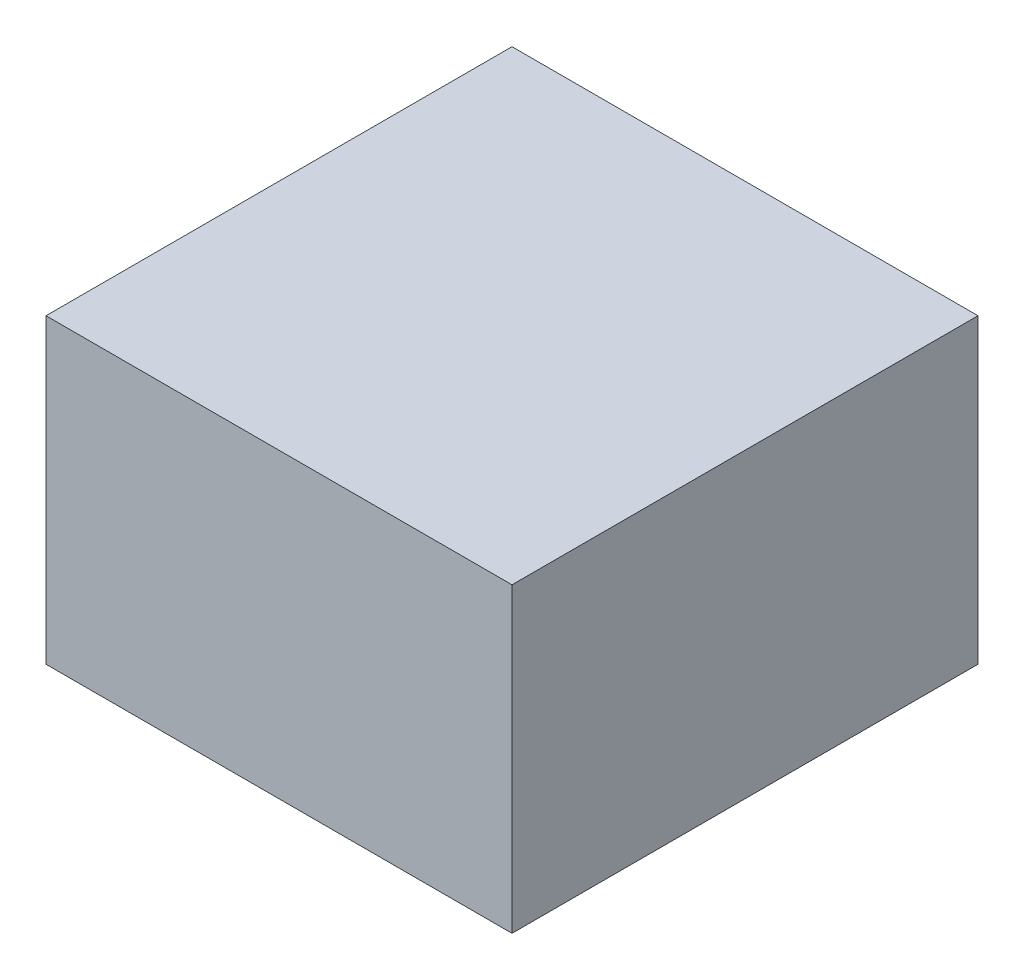
ISO-10303-21;
HEADER;
FILE_DESCRIPTION(('STEP AP214'),'2;1');
FILE_NAME('part.step','',(''),(''),'','','');
FILE_SCHEMA(('AUTOMOTIVE_DESIGN { 1 0 10303 214 1 1 1 1 }'));
ENDSEC;
DATA;
#1=APPLICATION_CONTEXT('core data for automotive mechanical design processes');
#2=APPLICATION_PROTOCOL_DEFINITION('international standard','automotive_design',2000,#1);
#3=PRODUCT_CONTEXT('',#1,'mechanical');
#4=PRODUCT('Part','Part','',(#3));
#5=PRODUCT_RELATED_PRODUCT_CATEGORY('part','',(#4));
#6=PRODUCT_DEFINITION_FORMATION('','',#4);
#7=PRODUCT_DEFINITION_CONTEXT('part definition',#1,'design');
#8=PRODUCT_DEFINITION('design','',#6,#7);
#9=PRODUCT_DEFINITION_SHAPE('','',#8);
#10=(LENGTH_UNIT() NAMED_UNIT(*) SI_UNIT(.MILLI.,.METRE.));
#11=(NAMED_UNIT(*) PLANE_ANGLE_UNIT() SI_UNIT($,.RADIAN.));
#12=(NAMED_UNIT(*) SI_UNIT($,.STERADIAN.) SOLID_ANGLE_UNIT());
#13=UNCERTAINTY_MEASURE_WITH_UNIT(LENGTH_MEASURE(1.E-05),#10,'distance_accuracy_value','');
#14=(GEOMETRIC_REPRESENTATION_CONTEXT(3) GLOBAL_UNCERTAINTY_ASSIGNED_CONTEXT((#13)) GLOBAL_UNIT_ASSIGNED_CONTEXT((#10,
#11,#12)) REPRESENTATION_CONTEXT('',''));
#15=CARTESIAN_POINT('',(0.,0.,0.));
#16=DIRECTION('',(0.,0.,1.));
#17=DIRECTION('',(1.,0.,0.));
#18=AXIS2_PLACEMENT_3D('',#15,#16,#17);
#19=CARTESIAN_POINT('',(0.880000000000002,1.14,-0.880000000000002));
#20=DIRECTION('',(-1.,0.,0.));
#21=DIRECTION('',(0.,0.,1.));
#22=AXIS2_PLACEMENT_3D('',#19,#20,#21);
#23=PLANE('',#22);
#24=DIRECTION('',(0.,0.,-1.));
#25=VECTOR('',#24,1.);
#26=CARTESIAN_POINT('',(0.880000000000002,0.,-0.880000000000002));
#27=LINE('',#26,#25);
#28=CARTESIAN_POINT('',(0.880000000000002,0.,0.879999999999998));
#29=VERTEX_POINT('',#28);
#30=CARTESIAN_POINT('',(0.880000000000002,0.,-0.880000000000002));
#31=VERTEX_POINT('',#30);
#32=EDGE_CURVE('E97',#29,#31,#27,.T.);
#33=ORIENTED_EDGE('',*,*,#32,.T.);
#34=DIRECTION('',(0.,-1.,0.));
#35=VECTOR('',#34,1.);
#36=CARTESIAN_POINT('',(0.880000000000002,1.14,-0.880000000000002));
#37=LINE('',#36,#35);
#38=CARTESIAN_POINT('',(0.880000000000002,1.14,-0.880000000000002));
#39=VERTEX_POINT('',#38);
#40=EDGE_CURVE('E11',#39,#31,#37,.T.);
#41=ORIENTED_EDGE('',*,*,#40,.F.);
#42=DIRECTION('',(0.,0.,-1.));
#43=VECTOR('',#42,1.);
#44=CARTESIAN_POINT('',(0.880000000000002,1.14,-0.880000000000002));
#45=LINE('',#44,#43);
#46=CARTESIAN_POINT('',(0.880000000000002,1.14,0.879999999999998));
#47=VERTEX_POINT('',#46);
#48=EDGE_CURVE('E85',#47,#39,#45,.T.);
#49=ORIENTED_EDGE('',*,*,#48,.F.);
#50=DIRECTION('',(0.,-1.,0.));
#51=VECTOR('',#50,1.);
#52=CARTESIAN_POINT('',(0.880000000000002,1.14,0.879999999999998));
#53=LINE('',#52,#51);
#54=EDGE_CURVE('E93',#47,#29,#53,.T.);
#55=ORIENTED_EDGE('',*,*,#54,.T.);
#56=EDGE_LOOP('',(#33,#41,#49,#55));
#57=FACE_BOUND('',#56,.T.);
#58=ADVANCED_FACE('F34',(#57),#23,.F.);
#59=CARTESIAN_POINT('',(-0.879999999999995,1.14,-0.880000000000002));
#60=DIRECTION('',(0.,0.,1.));
#61=DIRECTION('',(1.,0.,0.));
#62=AXIS2_PLACEMENT_3D('',#59,#60,#61);
#63=PLANE('',#62);
#64=DIRECTION('',(-1.,0.,0.));
#65=VECTOR('',#64,1.);
#66=CARTESIAN_POINT('',(-0.879999999999995,0.,-0.880000000000002));
#67=LINE('',#66,#65);
#68=CARTESIAN_POINT('',(-0.879999999999995,0.,-0.880000000000002));
#69=VERTEX_POINT('',#68);
#70=EDGE_CURVE('E89',#31,#69,#67,.T.);
#71=ORIENTED_EDGE('',*,*,#70,.T.);
#72=DIRECTION('',(0.,-1.,0.));
#73=VECTOR('',#72,1.);
#74=CARTESIAN_POINT('',(-0.879999999999995,1.14,-0.880000000000002));
#75=LINE('',#74,#73);
#76=CARTESIAN_POINT('',(-0.879999999999995,1.14,-0.880000000000002));
#77=VERTEX_POINT('',#76);
#78=EDGE_CURVE('E42',#77,#69,#75,.T.);
#79=ORIENTED_EDGE('',*,*,#78,.F.);
#80=DIRECTION('',(-1.,0.,0.));
#81=VECTOR('',#80,1.);
#82=CARTESIAN_POINT('',(-0.879999999999995,1.14,-0.880000000000002));
#83=LINE('',#82,#81);
#84=EDGE_CURVE('E80',#39,#77,#83,.T.);
#85=ORIENTED_EDGE('',*,*,#84,.F.);
#86=ORIENTED_EDGE('',*,*,#40,.T.);
#87=EDGE_LOOP('',(#71,#79,#85,#86));
#88=FACE_BOUND('',#87,.T.);
#89=ADVANCED_FACE('F88',(#88),#63,.F.);
#90=CARTESIAN_POINT('',(-0.879999999999995,1.14,-0.880000000000002));
#91=DIRECTION('',(1.,0.,0.));
#92=DIRECTION('',(0.,0.,-1.));
#93=AXIS2_PLACEMENT_3D('',#90,#91,#92);
#94=PLANE('',#93);
#95=DIRECTION('',(0.,0.,1.));
#96=VECTOR('',#95,1.);
#97=CARTESIAN_POINT('',(-0.879999999999995,0.,-0.880000000000002));
#98=LINE('',#97,#96);
#99=CARTESIAN_POINT('',(-0.879999999999995,0.,0.879999999999998));
#100=VERTEX_POINT('',#99);
#101=EDGE_CURVE('E67',#69,#100,#98,.T.);
#102=ORIENTED_EDGE('',*,*,#101,.T.);
#103=DIRECTION('',(0.,-1.,0.));
#104=VECTOR('',#103,1.);
#105=CARTESIAN_POINT('',(-0.879999999999995,1.14,0.879999999999998));
#106=LINE('',#105,#104);
#107=CARTESIAN_POINT('',(-0.879999999999995,1.14,0.879999999999998));
#108=VERTEX_POINT('',#107);
#109=EDGE_CURVE('E90',#108,#100,#106,.T.);
#110=ORIENTED_EDGE('',*,*,#109,.F.);
#111=DIRECTION('',(0.,0.,1.));
#112=VECTOR('',#111,1.);
#113=CARTESIAN_POINT('',(-0.879999999999995,1.14,-0.880000000000002));
#114=LINE('',#113,#112);
#115=EDGE_CURVE('E83',#77,#108,#114,.T.);
#116=ORIENTED_EDGE('',*,*,#115,.F.);
#117=ORIENTED_EDGE('',*,*,#78,.T.);
#118=EDGE_LOOP('',(#102,#110,#116,#117));
#119=FACE_BOUND('',#118,.T.);
#120=ADVANCED_FACE('F91',(#119),#94,.F.);
#121=CARTESIAN_POINT('',(-0.879999999999995,1.14,0.879999999999998));
#122=DIRECTION('',(0.,0.,-1.));
#123=DIRECTION('',(-1.,0.,0.));
#124=AXIS2_PLACEMENT_3D('',#121,#122,#123);
#125=PLANE('',#124);
#126=DIRECTION('',(1.,0.,0.));
#127=VECTOR('',#126,1.);
#128=CARTESIAN_POINT('',(-0.879999999999995,0.,0.879999999999998));
#129=LINE('',#128,#127);
#130=EDGE_CURVE('E73',#100,#29,#129,.T.);
#131=ORIENTED_EDGE('',*,*,#130,.T.);
#132=ORIENTED_EDGE('',*,*,#54,.F.);
#133=DIRECTION('',(1.,0.,0.));
#134=VECTOR('',#133,1.);
#135=CARTESIAN_POINT('',(-0.879999999999995,1.14,0.879999999999998));
#136=LINE('',#135,#134);
#137=EDGE_CURVE('E50',#108,#47,#136,.T.);
#138=ORIENTED_EDGE('',*,*,#137,.F.);
#139=ORIENTED_EDGE('',*,*,#109,.T.);
#140=EDGE_LOOP('',(#131,#132,#138,#139));
#141=FACE_BOUND('',#140,.T.);
#142=ADVANCED_FACE('F104',(#141),#125,.F.);
#143=CARTESIAN_POINT('',(0.,1.14,0.));
#144=DIRECTION('',(0.,1.,0.));
#145=DIRECTION('',(0.,0.,1.));
#146=AXIS2_PLACEMENT_3D('',#143,#144,#145);
#147=PLANE('',#146);
#148=ORIENTED_EDGE('',*,*,#48,.T.);
#149=ORIENTED_EDGE('',*,*,#84,.T.);
#150=ORIENTED_EDGE('',*,*,#115,.T.);
#151=ORIENTED_EDGE('',*,*,#137,.T.);
#152=EDGE_LOOP('',(#148,#149,#150,#151));
#153=FACE_BOUND('',#152,.T.);
#154=ADVANCED_FACE('F81',(#153),#147,.T.);
#155=CARTESIAN_POINT('',(0.,0.,0.));
#156=DIRECTION('',(0.,1.,0.));
#157=DIRECTION('',(0.,0.,1.));
#158=AXIS2_PLACEMENT_3D('',#155,#156,#157);
#159=PLANE('',#158);
#160=ORIENTED_EDGE('',*,*,#32,.F.);
#161=ORIENTED_EDGE('',*,*,#130,.F.);
#162=ORIENTED_EDGE('',*,*,#101,.F.);
#163=ORIENTED_EDGE('',*,*,#70,.F.);
#164=EDGE_LOOP('',(#160,#161,#162,#163));
#165=FACE_BOUND('',#164,.T.);
#166=ADVANCED_FACE('F107',(#165),#159,.F.);
#167=CLOSED_SHELL('',(#58,#89,#120,#142,#154,#166));
#168=MANIFOLD_SOLID_BREP('B2',#167);
#169=ADVANCED_BREP_SHAPE_REPRESENTATION('',(#18,#168),#14);
#170=SHAPE_DEFINITION_REPRESENTATION(#9,#169);
ENDSEC;
END-ISO-10303-21;
